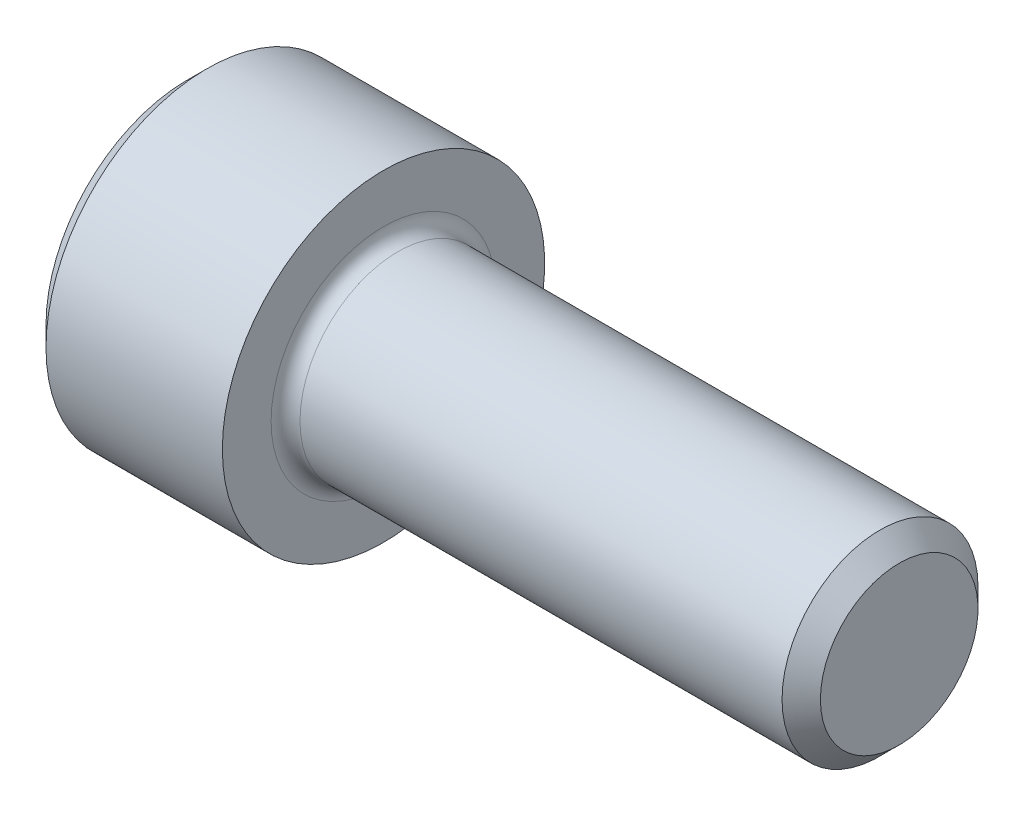
ISO-10303-21;
HEADER;
FILE_DESCRIPTION(('STEP AP214'),'2;1');
FILE_NAME('part.step','',(''),(''),'','','');
FILE_SCHEMA(('AUTOMOTIVE_DESIGN { 1 0 10303 214 1 1 1 1 }'));
ENDSEC;
DATA;
#1=APPLICATION_CONTEXT('core data for automotive mechanical design processes');
#2=APPLICATION_PROTOCOL_DEFINITION('international standard','automotive_design',2000,#1);
#3=PRODUCT_CONTEXT('',#1,'mechanical');
#4=PRODUCT('Part','Part','',(#3));
#5=PRODUCT_RELATED_PRODUCT_CATEGORY('part','',(#4));
#6=PRODUCT_DEFINITION_FORMATION('','',#4);
#7=PRODUCT_DEFINITION_CONTEXT('part definition',#1,'design');
#8=PRODUCT_DEFINITION('design','',#6,#7);
#9=PRODUCT_DEFINITION_SHAPE('','',#8);
#10=(LENGTH_UNIT() NAMED_UNIT(*) SI_UNIT(.MILLI.,.METRE.));
#11=(NAMED_UNIT(*) PLANE_ANGLE_UNIT() SI_UNIT($,.RADIAN.));
#12=(NAMED_UNIT(*) SI_UNIT($,.STERADIAN.) SOLID_ANGLE_UNIT());
#13=UNCERTAINTY_MEASURE_WITH_UNIT(LENGTH_MEASURE(1.E-05),#10,'distance_accuracy_value','');
#14=(GEOMETRIC_REPRESENTATION_CONTEXT(3) GLOBAL_UNCERTAINTY_ASSIGNED_CONTEXT((#13)) GLOBAL_UNIT_ASSIGNED_CONTEXT((#10,
#11,#12)) REPRESENTATION_CONTEXT('',''));
#15=CARTESIAN_POINT('',(0.,0.,0.));
#16=DIRECTION('',(0.,0.,1.));
#17=DIRECTION('',(1.,0.,0.));
#18=AXIS2_PLACEMENT_3D('',#15,#16,#17);
#19=CARTESIAN_POINT('',(0.,0.,0.));
#20=DIRECTION('',(-1.,0.,0.));
#21=DIRECTION('',(0.,0.,1.));
#22=AXIS2_PLACEMENT_3D('',#19,#20,#21);
#23=PLANE('',#22);
#24=DIRECTION('',(0.,-0.499999999999998,0.86602540378444));
#25=VECTOR('',#24,1.);
#26=CARTESIAN_POINT('',(0.,2.2920921156882,0.));
#27=LINE('',#26,#25);
#28=CARTESIAN_POINT('',(0.,2.2920921156882,0.));
#29=VERTEX_POINT('',#28);
#30=CARTESIAN_POINT('',(0.,1.14604605784411,1.98501));
#31=VERTEX_POINT('',#30);
#32=EDGE_CURVE('E272',#29,#31,#27,.T.);
#33=ORIENTED_EDGE('',*,*,#32,.T.);
#34=DIRECTION('',(0.,1.,0.));
#35=VECTOR('',#34,1.);
#36=CARTESIAN_POINT('',(0.,-1.14604605784409,1.98501));
#37=LINE('',#36,#35);
#38=CARTESIAN_POINT('',(0.,-1.14604605784409,1.98501));
#39=VERTEX_POINT('',#38);
#40=EDGE_CURVE('E132',#39,#31,#37,.T.);
#41=ORIENTED_EDGE('',*,*,#40,.F.);
#42=DIRECTION('',(0.,-0.500000000000001,-0.866025403784438));
#43=VECTOR('',#42,1.);
#44=CARTESIAN_POINT('',(0.,-1.14604605784409,1.98501));
#45=LINE('',#44,#43);
#46=CARTESIAN_POINT('',(0.,-2.29209211568819,0.));
#47=VERTEX_POINT('',#46);
#48=EDGE_CURVE('E275',#39,#47,#45,.T.);
#49=ORIENTED_EDGE('',*,*,#48,.T.);
#50=DIRECTION('',(0.,0.499999999999999,-0.86602540378444));
#51=VECTOR('',#50,1.);
#52=CARTESIAN_POINT('',(0.,-2.29209211568819,0.));
#53=LINE('',#52,#51);
#54=CARTESIAN_POINT('',(0.,-1.1460460578441,-1.98501));
#55=VERTEX_POINT('',#54);
#56=EDGE_CURVE('E278',#47,#55,#53,.T.);
#57=ORIENTED_EDGE('',*,*,#56,.T.);
#58=DIRECTION('',(0.,-1.,0.));
#59=VECTOR('',#58,1.);
#60=CARTESIAN_POINT('',(0.,1.1460460578441,-1.98501));
#61=LINE('',#60,#59);
#62=CARTESIAN_POINT('',(0.,1.1460460578441,-1.98501));
#63=VERTEX_POINT('',#62);
#64=EDGE_CURVE('E281',#63,#55,#61,.T.);
#65=ORIENTED_EDGE('',*,*,#64,.F.);
#66=DIRECTION('',(0.,-0.500000000000002,-0.866025403784438));
#67=VECTOR('',#66,1.);
#68=CARTESIAN_POINT('',(0.,2.2920921156882,0.));
#69=LINE('',#68,#67);
#70=EDGE_CURVE('E127',#29,#63,#69,.T.);
#71=ORIENTED_EDGE('',*,*,#70,.F.);
#72=EDGE_LOOP('',(#33,#41,#49,#57,#65,#71));
#73=FACE_BOUND('',#72,.T.);
#74=CARTESIAN_POINT('',(0.,0.,0.));
#75=DIRECTION('',(-1.,0.,0.));
#76=DIRECTION('',(0.,0.,1.));
#77=AXIS2_PLACEMENT_3D('',#74,#75,#76);
#78=CIRCLE('',#77,3.48615);
#79=CARTESIAN_POINT('',(0.,0.,3.48615));
#80=VERTEX_POINT('',#79);
#81=EDGE_CURVE('E156',#80,#80,#78,.T.);
#82=ORIENTED_EDGE('',*,*,#81,.T.);
#83=EDGE_LOOP('',(#82));
#84=FACE_BOUND('',#83,.T.);
#85=ADVANCED_FACE('F40',(#73,#84),#23,.T.);
#86=CARTESIAN_POINT('',(0.,0.,0.));
#87=DIRECTION('',(1.,0.,0.));
#88=DIRECTION('',(0.,0.,-1.));
#89=AXIS2_PLACEMENT_3D('',#86,#87,#88);
#90=CONICAL_SURFACE('',#89,3.48615,0.785398163397451);
#91=CARTESIAN_POINT('',(0.4826,0.,0.));
#92=DIRECTION('',(-1.,0.,0.));
#93=DIRECTION('',(0.,0.,1.));
#94=AXIS2_PLACEMENT_3D('',#91,#92,#93);
#95=CIRCLE('',#94,3.96875);
#96=CARTESIAN_POINT('',(0.4826,0.,3.96875));
#97=VERTEX_POINT('',#96);
#98=EDGE_CURVE('E153',#97,#97,#95,.T.);
#99=ORIENTED_EDGE('',*,*,#98,.T.);
#100=EDGE_LOOP('',(#99));
#101=FACE_BOUND('',#100,.T.);
#102=ORIENTED_EDGE('',*,*,#81,.F.);
#103=EDGE_LOOP('',(#102));
#104=FACE_BOUND('',#103,.T.);
#105=ADVANCED_FACE('F177',(#101,#104),#90,.T.);
#106=CARTESIAN_POINT('',(-31.75,0.,0.));
#107=DIRECTION('',(-1.,0.,0.));
#108=DIRECTION('',(0.,0.,1.));
#109=AXIS2_PLACEMENT_3D('',#106,#107,#108);
#110=CYLINDRICAL_SURFACE('',#109,3.96875);
#111=CARTESIAN_POINT('',(4.826,0.,0.));
#112=DIRECTION('',(-1.,0.,0.));
#113=DIRECTION('',(0.,0.,1.));
#114=AXIS2_PLACEMENT_3D('',#111,#112,#113);
#115=CIRCLE('',#114,3.96875);
#116=CARTESIAN_POINT('',(4.826,0.,3.96875));
#117=VERTEX_POINT('',#116);
#118=EDGE_CURVE('E150',#117,#117,#115,.T.);
#119=ORIENTED_EDGE('',*,*,#118,.T.);
#120=EDGE_LOOP('',(#119));
#121=FACE_BOUND('',#120,.T.);
#122=ORIENTED_EDGE('',*,*,#98,.F.);
#123=EDGE_LOOP('',(#122));
#124=FACE_BOUND('',#123,.T.);
#125=ADVANCED_FACE('F182',(#121,#124),#110,.T.);
#126=CARTESIAN_POINT('',(4.826,3.96875,0.));
#127=DIRECTION('',(1.,0.,0.));
#128=DIRECTION('',(0.,0.,-1.));
#129=AXIS2_PLACEMENT_3D('',#126,#127,#128);
#130=PLANE('',#129);
#131=CARTESIAN_POINT('',(4.826,0.,0.));
#132=DIRECTION('',(1.,0.,0.));
#133=DIRECTION('',(0.,0.,-1.));
#134=AXIS2_PLACEMENT_3D('',#131,#132,#133);
#135=CIRCLE('',#134,2.76859999999999);
#136=CARTESIAN_POINT('',(4.826,0.,-2.76859999999999));
#137=VERTEX_POINT('',#136);
#138=EDGE_CURVE('E48',#137,#137,#135,.F.);
#139=ORIENTED_EDGE('',*,*,#138,.T.);
#140=EDGE_LOOP('',(#139));
#141=FACE_BOUND('',#140,.T.);
#142=ORIENTED_EDGE('',*,*,#118,.F.);
#143=EDGE_LOOP('',(#142));
#144=FACE_BOUND('',#143,.T.);
#145=ADVANCED_FACE('F161',(#141,#144),#130,.T.);
#146=CARTESIAN_POINT('',(-31.75,0.,0.));
#147=DIRECTION('',(-1.,0.,0.));
#148=DIRECTION('',(0.,0.,1.));
#149=AXIS2_PLACEMENT_3D('',#146,#147,#148);
#150=CYLINDRICAL_SURFACE('',#149,2.41299999999999);
#151=CARTESIAN_POINT('',(5.1816,0.,0.));
#152=DIRECTION('',(1.,0.,0.));
#153=DIRECTION('',(0.,0.,-1.));
#154=AXIS2_PLACEMENT_3D('',#151,#152,#153);
#155=CIRCLE('',#154,2.41299999999999);
#156=CARTESIAN_POINT('',(5.1816,0.,-2.41299999999999));
#157=VERTEX_POINT('',#156);
#158=EDGE_CURVE('E11',#157,#157,#155,.T.);
#159=ORIENTED_EDGE('',*,*,#158,.T.);
#160=EDGE_LOOP('',(#159));
#161=FACE_BOUND('',#160,.T.);
#162=CARTESIAN_POINT('',(17.05356,0.,0.));
#163=DIRECTION('',(-1.,0.,0.));
#164=DIRECTION('',(0.,0.,1.));
#165=AXIS2_PLACEMENT_3D('',#162,#163,#164);
#166=CIRCLE('',#165,2.41299999999997);
#167=CARTESIAN_POINT('',(17.05356,0.,2.41299999999997));
#168=VERTEX_POINT('',#167);
#169=EDGE_CURVE('E147',#168,#168,#166,.T.);
#170=ORIENTED_EDGE('',*,*,#169,.T.);
#171=EDGE_LOOP('',(#170));
#172=FACE_BOUND('',#171,.T.);
#173=ADVANCED_FACE('F192',(#161,#172),#150,.T.);
#174=CARTESIAN_POINT('',(17.526,0.,0.));
#175=DIRECTION('',(-1.,0.,0.));
#176=DIRECTION('',(0.,0.,1.));
#177=AXIS2_PLACEMENT_3D('',#174,#175,#176);
#178=CONICAL_SURFACE('',#177,1.94056,0.7853981633974);
#179=ORIENTED_EDGE('',*,*,#169,.F.);
#180=EDGE_LOOP('',(#179));
#181=FACE_BOUND('',#180,.T.);
#182=CARTESIAN_POINT('',(17.526,0.,0.));
#183=DIRECTION('',(-1.,0.,0.));
#184=DIRECTION('',(0.,0.,1.));
#185=AXIS2_PLACEMENT_3D('',#182,#183,#184);
#186=CIRCLE('',#185,1.94056);
#187=CARTESIAN_POINT('',(17.526,0.,1.94056));
#188=VERTEX_POINT('',#187);
#189=EDGE_CURVE('E143',#188,#188,#186,.T.);
#190=ORIENTED_EDGE('',*,*,#189,.T.);
#191=EDGE_LOOP('',(#190));
#192=FACE_BOUND('',#191,.T.);
#193=ADVANCED_FACE('F172',(#181,#192),#178,.T.);
#194=CARTESIAN_POINT('',(17.526,1.94056,0.));
#195=DIRECTION('',(1.,0.,0.));
#196=DIRECTION('',(0.,0.,-1.));
#197=AXIS2_PLACEMENT_3D('',#194,#195,#196);
#198=PLANE('',#197);
#199=ORIENTED_EDGE('',*,*,#189,.F.);
#200=EDGE_LOOP('',(#199));
#201=FACE_BOUND('',#200,.T.);
#202=ADVANCED_FACE('F165',(#201),#198,.T.);
#203=CARTESIAN_POINT('',(5.1816,0.,0.));
#204=DIRECTION('',(1.,0.,0.));
#205=DIRECTION('',(0.,0.,-1.));
#206=AXIS2_PLACEMENT_3D('',#203,#204,#205);
#207=TOROIDAL_SURFACE('',#206,2.76859999999999,0.3556);
#208=ORIENTED_EDGE('',*,*,#158,.F.);
#209=EDGE_LOOP('',(#208));
#210=FACE_BOUND('',#209,.T.);
#211=ORIENTED_EDGE('',*,*,#138,.F.);
#212=EDGE_LOOP('',(#211));
#213=FACE_BOUND('',#212,.T.);
#214=ADVANCED_FACE('F42',(#210,#213),#207,.F.);
#215=CARTESIAN_POINT('',(2.286,2.2920921156882,0.));
#216=DIRECTION('',(0.,-0.866025403784439,-0.499999999999998));
#217=DIRECTION('',(0.,0.499999999999998,-0.86602540378444));
#218=AXIS2_PLACEMENT_3D('',#215,#216,#217);
#219=PLANE('',#218);
#220=ORIENTED_EDGE('',*,*,#32,.F.);
#221=DIRECTION('',(-1.,0.,0.));
#222=VECTOR('',#221,1.);
#223=CARTESIAN_POINT('',(2.286,2.2920921156882,0.));
#224=LINE('',#223,#222);
#225=CARTESIAN_POINT('',(2.286,2.2920921156882,0.));
#226=VERTEX_POINT('',#225);
#227=EDGE_CURVE('E271',#226,#29,#224,.T.);
#228=ORIENTED_EDGE('',*,*,#227,.F.);
#229=DIRECTION('',(0.,-0.499999999999998,0.86602540378444));
#230=VECTOR('',#229,1.);
#231=CARTESIAN_POINT('',(2.286,2.2920921156882,0.));
#232=LINE('',#231,#230);
#233=CARTESIAN_POINT('',(2.286,1.71906908676615,0.992504999999996));
#234=VERTEX_POINT('',#233);
#235=EDGE_CURVE('E55',#226,#234,#232,.T.);
#236=ORIENTED_EDGE('',*,*,#235,.T.);
#237=CARTESIAN_POINT('',(2.286,1.14604605784411,1.98501));
#238=VERTEX_POINT('',#237);
#239=EDGE_CURVE('E113',#234,#238,#232,.T.);
#240=ORIENTED_EDGE('',*,*,#239,.T.);
#241=DIRECTION('',(-1.,0.,0.));
#242=VECTOR('',#241,1.);
#243=CARTESIAN_POINT('',(2.286,1.14604605784411,1.98501));
#244=LINE('',#243,#242);
#245=EDGE_CURVE('E125',#238,#31,#244,.T.);
#246=ORIENTED_EDGE('',*,*,#245,.T.);
#247=EDGE_LOOP('',(#220,#228,#236,#240,#246));
#248=FACE_BOUND('',#247,.T.);
#249=ADVANCED_FACE('F124',(#248),#219,.T.);
#250=CARTESIAN_POINT('',(2.286,-1.14604605784409,1.98501));
#251=DIRECTION('',(0.,0.,1.));
#252=DIRECTION('',(0.,-1.,0.));
#253=AXIS2_PLACEMENT_3D('',#250,#251,#252);
#254=PLANE('',#253);
#255=ORIENTED_EDGE('',*,*,#40,.T.);
#256=ORIENTED_EDGE('',*,*,#245,.F.);
#257=DIRECTION('',(0.,1.,0.));
#258=VECTOR('',#257,1.);
#259=CARTESIAN_POINT('',(2.286,-1.14604605784409,1.98501));
#260=LINE('',#259,#258);
#261=CARTESIAN_POINT('',(2.286,0.,1.98501));
#262=VERTEX_POINT('',#261);
#263=EDGE_CURVE('E111',#262,#238,#260,.T.);
#264=ORIENTED_EDGE('',*,*,#263,.F.);
#265=CARTESIAN_POINT('',(2.286,-1.14604605784409,1.98501));
#266=VERTEX_POINT('',#265);
#267=EDGE_CURVE('E121',#266,#262,#260,.T.);
#268=ORIENTED_EDGE('',*,*,#267,.F.);
#269=DIRECTION('',(-1.,0.,0.));
#270=VECTOR('',#269,1.);
#271=CARTESIAN_POINT('',(2.286,-1.14604605784409,1.98501));
#272=LINE('',#271,#270);
#273=EDGE_CURVE('E134',#266,#39,#272,.T.);
#274=ORIENTED_EDGE('',*,*,#273,.T.);
#275=EDGE_LOOP('',(#255,#256,#264,#268,#274));
#276=FACE_BOUND('',#275,.T.);
#277=ADVANCED_FACE('F129',(#276),#254,.F.);
#278=CARTESIAN_POINT('',(2.286,-1.14604605784409,1.98501));
#279=DIRECTION('',(0.,0.866025403784438,-0.500000000000001));
#280=DIRECTION('',(0.,0.500000000000001,0.866025403784438));
#281=AXIS2_PLACEMENT_3D('',#278,#279,#280);
#282=PLANE('',#281);
#283=ORIENTED_EDGE('',*,*,#48,.F.);
#284=ORIENTED_EDGE('',*,*,#273,.F.);
#285=DIRECTION('',(0.,-0.500000000000001,-0.866025403784438));
#286=VECTOR('',#285,1.);
#287=CARTESIAN_POINT('',(2.286,-1.14604605784409,1.98501));
#288=LINE('',#287,#286);
#289=CARTESIAN_POINT('',(2.286,-1.71906908676614,0.992505));
#290=VERTEX_POINT('',#289);
#291=EDGE_CURVE('E252',#266,#290,#288,.T.);
#292=ORIENTED_EDGE('',*,*,#291,.T.);
#293=CARTESIAN_POINT('',(2.286,-2.29209211568819,0.));
#294=VERTEX_POINT('',#293);
#295=EDGE_CURVE('E254',#290,#294,#288,.T.);
#296=ORIENTED_EDGE('',*,*,#295,.T.);
#297=DIRECTION('',(-1.,0.,0.));
#298=VECTOR('',#297,1.);
#299=CARTESIAN_POINT('',(2.286,-2.29209211568819,0.));
#300=LINE('',#299,#298);
#301=EDGE_CURVE('E139',#294,#47,#300,.T.);
#302=ORIENTED_EDGE('',*,*,#301,.T.);
#303=EDGE_LOOP('',(#283,#284,#292,#296,#302));
#304=FACE_BOUND('',#303,.T.);
#305=ADVANCED_FACE('F204',(#304),#282,.T.);
#306=CARTESIAN_POINT('',(2.286,-2.29209211568819,0.));
#307=DIRECTION('',(0.,0.866025403784439,0.499999999999999));
#308=DIRECTION('',(0.,-0.499999999999999,0.866025403784439));
#309=AXIS2_PLACEMENT_3D('',#306,#307,#308);
#310=PLANE('',#309);
#311=ORIENTED_EDGE('',*,*,#56,.F.);
#312=ORIENTED_EDGE('',*,*,#301,.F.);
#313=DIRECTION('',(0.,0.499999999999999,-0.86602540378444));
#314=VECTOR('',#313,1.);
#315=CARTESIAN_POINT('',(2.286,-2.29209211568819,0.));
#316=LINE('',#315,#314);
#317=CARTESIAN_POINT('',(2.286,-1.71906908676615,-0.992504999999996));
#318=VERTEX_POINT('',#317);
#319=EDGE_CURVE('E257',#294,#318,#316,.T.);
#320=ORIENTED_EDGE('',*,*,#319,.T.);
#321=CARTESIAN_POINT('',(2.286,-1.1460460578441,-1.98501));
#322=VERTEX_POINT('',#321);
#323=EDGE_CURVE('E261',#318,#322,#316,.T.);
#324=ORIENTED_EDGE('',*,*,#323,.T.);
#325=DIRECTION('',(-1.,0.,0.));
#326=VECTOR('',#325,1.);
#327=CARTESIAN_POINT('',(2.286,-1.1460460578441,-1.98501));
#328=LINE('',#327,#326);
#329=EDGE_CURVE('E290',#322,#55,#328,.T.);
#330=ORIENTED_EDGE('',*,*,#329,.T.);
#331=EDGE_LOOP('',(#311,#312,#320,#324,#330));
#332=FACE_BOUND('',#331,.T.);
#333=ADVANCED_FACE('F207',(#332),#310,.T.);
#334=CARTESIAN_POINT('',(2.286,1.1460460578441,-1.98501));
#335=DIRECTION('',(0.,0.,-1.));
#336=DIRECTION('',(0.,1.,0.));
#337=AXIS2_PLACEMENT_3D('',#334,#335,#336);
#338=PLANE('',#337);
#339=ORIENTED_EDGE('',*,*,#64,.T.);
#340=ORIENTED_EDGE('',*,*,#329,.F.);
#341=DIRECTION('',(0.,-1.,0.));
#342=VECTOR('',#341,1.);
#343=CARTESIAN_POINT('',(2.286,1.1460460578441,-1.98501));
#344=LINE('',#343,#342);
#345=CARTESIAN_POINT('',(2.286,0.,-1.98501));
#346=VERTEX_POINT('',#345);
#347=EDGE_CURVE('E265',#346,#322,#344,.T.);
#348=ORIENTED_EDGE('',*,*,#347,.F.);
#349=CARTESIAN_POINT('',(2.286,1.1460460578441,-1.98501));
#350=VERTEX_POINT('',#349);
#351=EDGE_CURVE('E266',#350,#346,#344,.T.);
#352=ORIENTED_EDGE('',*,*,#351,.F.);
#353=DIRECTION('',(-1.,0.,0.));
#354=VECTOR('',#353,1.);
#355=CARTESIAN_POINT('',(2.286,1.1460460578441,-1.98501));
#356=LINE('',#355,#354);
#357=EDGE_CURVE('E287',#350,#63,#356,.T.);
#358=ORIENTED_EDGE('',*,*,#357,.T.);
#359=EDGE_LOOP('',(#339,#340,#348,#352,#358));
#360=FACE_BOUND('',#359,.T.);
#361=ADVANCED_FACE('F211',(#360),#338,.F.);
#362=CARTESIAN_POINT('',(2.286,2.2920921156882,0.));
#363=DIRECTION('',(0.,0.866025403784438,-0.500000000000002));
#364=DIRECTION('',(0.,0.500000000000002,0.866025403784438));
#365=AXIS2_PLACEMENT_3D('',#362,#363,#364);
#366=PLANE('',#365);
#367=ORIENTED_EDGE('',*,*,#70,.T.);
#368=ORIENTED_EDGE('',*,*,#357,.F.);
#369=DIRECTION('',(0.,-0.500000000000002,-0.866025403784438));
#370=VECTOR('',#369,1.);
#371=CARTESIAN_POINT('',(2.286,2.2920921156882,0.));
#372=LINE('',#371,#370);
#373=CARTESIAN_POINT('',(2.286,1.71906908676615,-0.992505000000006));
#374=VERTEX_POINT('',#373);
#375=EDGE_CURVE('E269',#374,#350,#372,.T.);
#376=ORIENTED_EDGE('',*,*,#375,.F.);
#377=EDGE_CURVE('E243',#226,#374,#372,.T.);
#378=ORIENTED_EDGE('',*,*,#377,.F.);
#379=ORIENTED_EDGE('',*,*,#227,.T.);
#380=EDGE_LOOP('',(#367,#368,#376,#378,#379));
#381=FACE_BOUND('',#380,.T.);
#382=ADVANCED_FACE('F215',(#381),#366,.F.);
#383=CARTESIAN_POINT('',(2.286,1.14604605784411,1.98501));
#384=DIRECTION('',(-1.,0.,0.));
#385=DIRECTION('',(0.,0.,1.));
#386=AXIS2_PLACEMENT_3D('',#383,#384,#385);
#387=PLANE('',#386);
#388=CARTESIAN_POINT('',(2.286,0.,0.));
#389=DIRECTION('',(-1.,0.,0.));
#390=DIRECTION('',(0.,0.,1.));
#391=AXIS2_PLACEMENT_3D('',#388,#389,#390);
#392=CIRCLE('',#391,1.98501);
#393=EDGE_CURVE('E133',#290,#262,#392,.T.);
#394=ORIENTED_EDGE('',*,*,#393,.F.);
#395=ORIENTED_EDGE('',*,*,#291,.F.);
#396=ORIENTED_EDGE('',*,*,#267,.T.);
#397=EDGE_LOOP('',(#394,#395,#396));
#398=FACE_BOUND('',#397,.T.);
#399=ADVANCED_FACE('F219',(#398),#387,.T.);
#400=EDGE_CURVE('E137',#318,#290,#392,.T.);
#401=ORIENTED_EDGE('',*,*,#400,.F.);
#402=ORIENTED_EDGE('',*,*,#319,.F.);
#403=ORIENTED_EDGE('',*,*,#295,.F.);
#404=EDGE_LOOP('',(#401,#402,#403));
#405=FACE_BOUND('',#404,.T.);
#406=ADVANCED_FACE('F222',(#405),#387,.T.);
#407=EDGE_CURVE('E296',#346,#318,#392,.T.);
#408=ORIENTED_EDGE('',*,*,#407,.F.);
#409=ORIENTED_EDGE('',*,*,#347,.T.);
#410=ORIENTED_EDGE('',*,*,#323,.F.);
#411=EDGE_LOOP('',(#408,#409,#410));
#412=FACE_BOUND('',#411,.T.);
#413=ADVANCED_FACE('F227',(#412),#387,.T.);
#414=EDGE_CURVE('E246',#374,#346,#392,.T.);
#415=ORIENTED_EDGE('',*,*,#414,.F.);
#416=ORIENTED_EDGE('',*,*,#375,.T.);
#417=ORIENTED_EDGE('',*,*,#351,.T.);
#418=EDGE_LOOP('',(#415,#416,#417));
#419=FACE_BOUND('',#418,.T.);
#420=ADVANCED_FACE('F234',(#419),#387,.T.);
#421=EDGE_CURVE('E144',#234,#374,#392,.T.);
#422=ORIENTED_EDGE('',*,*,#421,.F.);
#423=ORIENTED_EDGE('',*,*,#235,.F.);
#424=ORIENTED_EDGE('',*,*,#377,.T.);
#425=EDGE_LOOP('',(#422,#423,#424));
#426=FACE_BOUND('',#425,.T.);
#427=ADVANCED_FACE('F230',(#426),#387,.T.);
#428=EDGE_CURVE('E116',#262,#234,#392,.T.);
#429=ORIENTED_EDGE('',*,*,#428,.F.);
#430=ORIENTED_EDGE('',*,*,#263,.T.);
#431=ORIENTED_EDGE('',*,*,#239,.F.);
#432=EDGE_LOOP('',(#429,#430,#431));
#433=FACE_BOUND('',#432,.T.);
#434=ADVANCED_FACE('F112',(#433),#387,.T.);
#435=CARTESIAN_POINT('',(2.286,0.,0.));
#436=DIRECTION('',(-1.,0.,0.));
#437=DIRECTION('',(0.,0.,1.));
#438=AXIS2_PLACEMENT_3D('',#435,#436,#437);
#439=CONICAL_SURFACE('',#438,1.98501,1.04719755119659);
#440=CARTESIAN_POINT('',(3.43204605784411,0.,0.));
#441=VERTEX_POINT('',#440);
#442=VERTEX_LOOP('',#441);
#443=FACE_BOUND('',#442,.T.);
#444=ORIENTED_EDGE('',*,*,#428,.T.);
#445=ORIENTED_EDGE('',*,*,#421,.T.);
#446=ORIENTED_EDGE('',*,*,#414,.T.);
#447=ORIENTED_EDGE('',*,*,#407,.T.);
#448=ORIENTED_EDGE('',*,*,#400,.T.);
#449=ORIENTED_EDGE('',*,*,#393,.T.);
#450=EDGE_LOOP('',(#444,#445,#446,#447,#448,#449));
#451=FACE_BOUND('',#450,.T.);
#452=ADVANCED_FACE('F199',(#443,#451),#439,.F.);
#453=CLOSED_SHELL('',(#85,#105,#125,#145,#173,#193,#202,#214,#249,#277,#305,#333,#361,#382,#399,
#406,#413,#420,#427,#434,#452));
#454=MANIFOLD_SOLID_BREP('B2',#453);
#455=ADVANCED_BREP_SHAPE_REPRESENTATION('',(#18,#454),#14);
#456=SHAPE_DEFINITION_REPRESENTATION(#9,#455);
ENDSEC;
END-ISO-10303-21;
